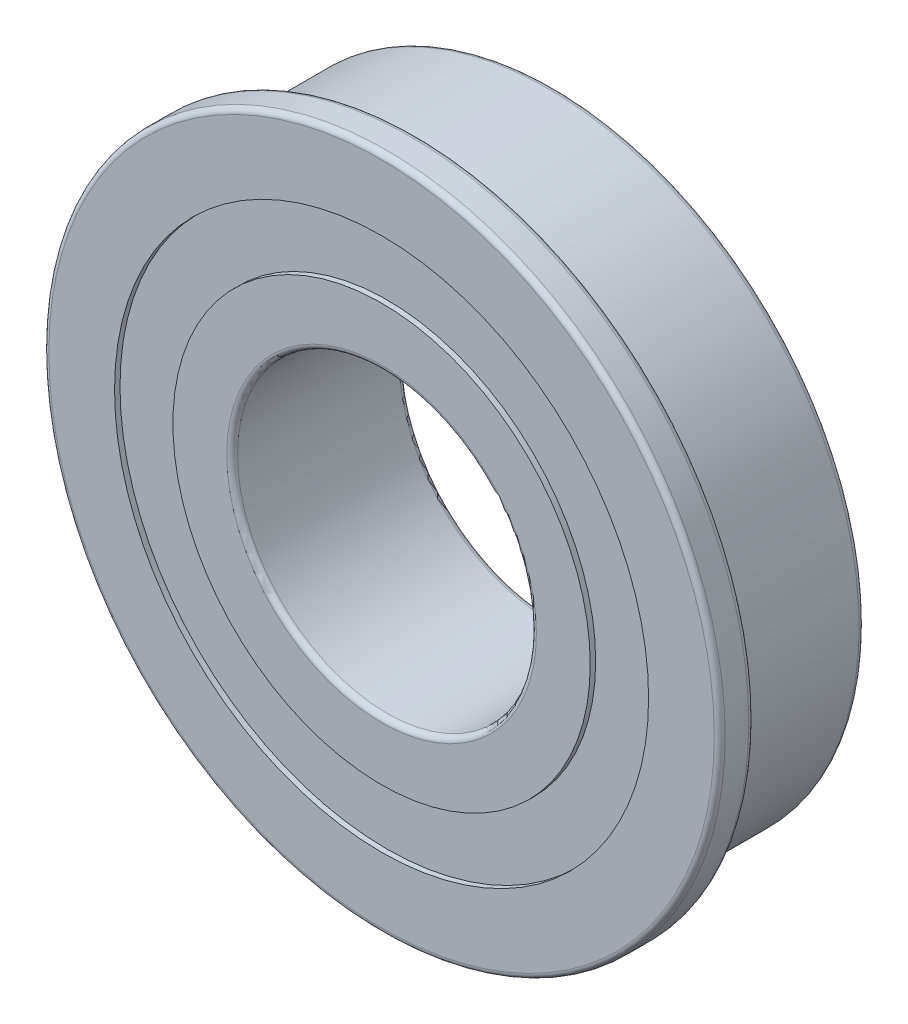
ISO-10303-21;
HEADER;
FILE_DESCRIPTION(('STEP AP214'),'2;1');
FILE_NAME('part.step','',(''),(''),'','','');
FILE_SCHEMA(('AUTOMOTIVE_DESIGN { 1 0 10303 214 1 1 1 1 }'));
ENDSEC;
DATA;
#1=APPLICATION_CONTEXT('core data for automotive mechanical design processes');
#2=APPLICATION_PROTOCOL_DEFINITION('international standard','automotive_design',2000,#1);
#3=PRODUCT_CONTEXT('',#1,'mechanical');
#4=PRODUCT('Part','Part','',(#3));
#5=PRODUCT_RELATED_PRODUCT_CATEGORY('part','',(#4));
#6=PRODUCT_DEFINITION_FORMATION('','',#4);
#7=PRODUCT_DEFINITION_CONTEXT('part definition',#1,'design');
#8=PRODUCT_DEFINITION('design','',#6,#7);
#9=PRODUCT_DEFINITION_SHAPE('','',#8);
#10=(LENGTH_UNIT() NAMED_UNIT(*) SI_UNIT(.MILLI.,.METRE.));
#11=(NAMED_UNIT(*) PLANE_ANGLE_UNIT() SI_UNIT($,.RADIAN.));
#12=(NAMED_UNIT(*) SI_UNIT($,.STERADIAN.) SOLID_ANGLE_UNIT());
#13=UNCERTAINTY_MEASURE_WITH_UNIT(LENGTH_MEASURE(1.E-05),#10,'distance_accuracy_value','');
#14=(GEOMETRIC_REPRESENTATION_CONTEXT(3) GLOBAL_UNCERTAINTY_ASSIGNED_CONTEXT((#13)) GLOBAL_UNIT_ASSIGNED_CONTEXT((#10,
#11,#12)) REPRESENTATION_CONTEXT('',''));
#15=CARTESIAN_POINT('',(0.,0.,0.));
#16=DIRECTION('',(0.,0.,1.));
#17=DIRECTION('',(1.,0.,0.));
#18=AXIS2_PLACEMENT_3D('',#15,#16,#17);
#19=CARTESIAN_POINT('',(0.,0.,53.2489151398073));
#20=DIRECTION('',(0.,0.,1.));
#21=DIRECTION('',(1.,0.,0.));
#22=AXIS2_PLACEMENT_3D('',#19,#20,#21);
#23=CYLINDRICAL_SURFACE('',#22,12.2875);
#24=CARTESIAN_POINT('',(0.,0.,-3.96875));
#25=DIRECTION('',(0.,0.,1.));
#26=DIRECTION('',(1.,0.,0.));
#27=AXIS2_PLACEMENT_3D('',#24,#25,#26);
#28=CIRCLE('',#27,12.2875);
#29=CARTESIAN_POINT('',(12.2875,0.,-3.96875));
#30=VERTEX_POINT('',#29);
#31=EDGE_CURVE('E407',#30,#30,#28,.F.);
#32=ORIENTED_EDGE('',*,*,#31,.T.);
#33=EDGE_LOOP('',(#32));
#34=FACE_BOUND('',#33,.T.);
#35=CARTESIAN_POINT('',(0.,0.,-3.71875));
#36=DIRECTION('',(0.,0.,1.));
#37=DIRECTION('',(1.,0.,0.));
#38=AXIS2_PLACEMENT_3D('',#35,#36,#37);
#39=CIRCLE('',#38,12.2875);
#40=CARTESIAN_POINT('',(12.2875,0.,-3.71875));
#41=VERTEX_POINT('',#40);
#42=EDGE_CURVE('E80',#41,#41,#39,.T.);
#43=ORIENTED_EDGE('',*,*,#42,.T.);
#44=EDGE_LOOP('',(#43));
#45=FACE_BOUND('',#44,.T.);
#46=ADVANCED_FACE('F17',(#34,#45),#23,.F.);
#47=CARTESIAN_POINT('',(0.,12.2875,-3.96875));
#48=DIRECTION('',(0.,0.,1.));
#49=DIRECTION('',(1.,0.,0.));
#50=AXIS2_PLACEMENT_3D('',#47,#48,#49);
#51=PLANE('',#50);
#52=ORIENTED_EDGE('',*,*,#31,.F.);
#53=EDGE_LOOP('',(#52));
#54=FACE_BOUND('',#53,.T.);
#55=CARTESIAN_POINT('',(0.,0.,-3.96875));
#56=DIRECTION('',(0.,0.,1.));
#57=DIRECTION('',(1.,0.,0.));
#58=AXIS2_PLACEMENT_3D('',#55,#56,#57);
#59=CIRCLE('',#58,14.0375);
#60=CARTESIAN_POINT('',(14.0375,0.,-3.96875));
#61=VERTEX_POINT('',#60);
#62=CARTESIAN_POINT('',(-14.0375,0.,-3.96875));
#63=VERTEX_POINT('',#62);
#64=EDGE_CURVE('E70',#61,#63,#59,.T.);
#65=ORIENTED_EDGE('',*,*,#64,.F.);
#66=CARTESIAN_POINT('',(0.,0.,-3.96875));
#67=DIRECTION('',(0.,0.,1.));
#68=DIRECTION('',(-1.,0.,0.));
#69=AXIS2_PLACEMENT_3D('',#66,#67,#68);
#70=CIRCLE('',#69,14.0375);
#71=EDGE_CURVE('E68',#63,#61,#70,.T.);
#72=ORIENTED_EDGE('',*,*,#71,.F.);
#73=EDGE_LOOP('',(#65,#72));
#74=FACE_BOUND('',#73,.T.);
#75=ADVANCED_FACE('F79',(#54,#74),#51,.F.);
#76=CARTESIAN_POINT('',(0.,9.602,-3.71875));
#77=DIRECTION('',(0.,0.,1.));
#78=DIRECTION('',(1.,0.,0.));
#79=AXIS2_PLACEMENT_3D('',#76,#77,#78);
#80=PLANE('',#79);
#81=CARTESIAN_POINT('',(0.,0.,-3.71875));
#82=DIRECTION('',(0.,0.,1.));
#83=DIRECTION('',(1.,0.,0.));
#84=AXIS2_PLACEMENT_3D('',#81,#82,#83);
#85=CIRCLE('',#84,9.602);
#86=CARTESIAN_POINT('',(9.602,0.,-3.71875));
#87=VERTEX_POINT('',#86);
#88=EDGE_CURVE('E75',#87,#87,#85,.F.);
#89=ORIENTED_EDGE('',*,*,#88,.F.);
#90=EDGE_LOOP('',(#89));
#91=FACE_BOUND('',#90,.T.);
#92=ORIENTED_EDGE('',*,*,#42,.F.);
#93=EDGE_LOOP('',(#92));
#94=FACE_BOUND('',#93,.T.);
#95=ADVANCED_FACE('F94',(#91,#94),#80,.F.);
#96=CARTESIAN_POINT('',(0.,0.,-3.71875));
#97=DIRECTION('',(0.,0.,1.));
#98=DIRECTION('',(1.,0.,0.));
#99=AXIS2_PLACEMENT_3D('',#96,#97,#98);
#100=TOROIDAL_SURFACE('',#99,14.0375,0.25);
#101=CARTESIAN_POINT('',(0.,0.,-3.71875));
#102=DIRECTION('',(0.,0.,1.));
#103=DIRECTION('',(1.,0.,0.));
#104=AXIS2_PLACEMENT_3D('',#101,#102,#103);
#105=CIRCLE('',#104,14.2875);
#106=CARTESIAN_POINT('',(14.2875,0.,-3.71875));
#107=VERTEX_POINT('',#106);
#108=EDGE_CURVE('E109',#107,#107,#105,.T.);
#109=ORIENTED_EDGE('',*,*,#108,.F.);
#110=EDGE_LOOP('',(#109));
#111=FACE_BOUND('',#110,.T.);
#112=ORIENTED_EDGE('',*,*,#64,.T.);
#113=ORIENTED_EDGE('',*,*,#71,.T.);
#114=EDGE_LOOP('',(#112,#113));
#115=FACE_BOUND('',#114,.T.);
#116=ADVANCED_FACE('F72',(#111,#115),#100,.T.);
#117=CARTESIAN_POINT('',(0.,0.,53.2489151398073));
#118=DIRECTION('',(0.,0.,1.));
#119=DIRECTION('',(1.,0.,0.));
#120=AXIS2_PLACEMENT_3D('',#117,#118,#119);
#121=CYLINDRICAL_SURFACE('',#120,9.602);
#122=ORIENTED_EDGE('',*,*,#88,.T.);
#123=EDGE_LOOP('',(#122));
#124=FACE_BOUND('',#123,.T.);
#125=CARTESIAN_POINT('',(0.,0.,-3.96875));
#126=DIRECTION('',(0.,0.,1.));
#127=DIRECTION('',(1.,0.,0.));
#128=AXIS2_PLACEMENT_3D('',#125,#126,#127);
#129=CIRCLE('',#128,9.602);
#130=CARTESIAN_POINT('',(9.602,0.,-3.96875));
#131=VERTEX_POINT('',#130);
#132=EDGE_CURVE('E112',#131,#131,#129,.T.);
#133=ORIENTED_EDGE('',*,*,#132,.T.);
#134=EDGE_LOOP('',(#133));
#135=FACE_BOUND('',#134,.T.);
#136=ADVANCED_FACE('F103',(#124,#135),#121,.T.);
#137=CARTESIAN_POINT('',(0.,0.,53.2489151398073));
#138=DIRECTION('',(0.,0.,1.));
#139=DIRECTION('',(1.,0.,0.));
#140=AXIS2_PLACEMENT_3D('',#137,#138,#139);
#141=CYLINDRICAL_SURFACE('',#140,14.2875);
#142=CARTESIAN_POINT('',(0.,0.,1.63125));
#143=DIRECTION('',(0.,0.,-1.));
#144=DIRECTION('',(-1.,0.,0.));
#145=AXIS2_PLACEMENT_3D('',#142,#143,#144);
#146=CIRCLE('',#145,14.2875);
#147=CARTESIAN_POINT('',(-14.2875,0.,1.63125));
#148=VERTEX_POINT('',#147);
#149=EDGE_CURVE('E113',#148,#148,#146,.F.);
#150=ORIENTED_EDGE('',*,*,#149,.F.);
#151=EDGE_LOOP('',(#150));
#152=FACE_BOUND('',#151,.T.);
#153=ORIENTED_EDGE('',*,*,#108,.T.);
#154=EDGE_LOOP('',(#153));
#155=FACE_BOUND('',#154,.T.);
#156=ADVANCED_FACE('F163',(#152,#155),#141,.T.);
#157=CARTESIAN_POINT('',(0.,6.875,-3.96875));
#158=DIRECTION('',(0.,0.,1.));
#159=DIRECTION('',(1.,0.,0.));
#160=AXIS2_PLACEMENT_3D('',#157,#158,#159);
#161=PLANE('',#160);
#162=ORIENTED_EDGE('',*,*,#132,.F.);
#163=EDGE_LOOP('',(#162));
#164=FACE_BOUND('',#163,.T.);
#165=CARTESIAN_POINT('',(0.,0.,-3.96875));
#166=DIRECTION('',(0.,0.,-1.));
#167=DIRECTION('',(1.,0.,0.));
#168=AXIS2_PLACEMENT_3D('',#165,#166,#167);
#169=CIRCLE('',#168,7.125);
#170=CARTESIAN_POINT('',(7.125,0.,-3.96875));
#171=VERTEX_POINT('',#170);
#172=CARTESIAN_POINT('',(-7.125,0.,-3.96875));
#173=VERTEX_POINT('',#172);
#174=EDGE_CURVE('E116',#171,#173,#169,.T.);
#175=ORIENTED_EDGE('',*,*,#174,.F.);
#176=CARTESIAN_POINT('',(0.,0.,-3.96875));
#177=DIRECTION('',(0.,0.,-1.));
#178=DIRECTION('',(-1.,0.,0.));
#179=AXIS2_PLACEMENT_3D('',#176,#177,#178);
#180=CIRCLE('',#179,7.125);
#181=EDGE_CURVE('E147',#173,#171,#180,.T.);
#182=ORIENTED_EDGE('',*,*,#181,.F.);
#183=EDGE_LOOP('',(#175,#182));
#184=FACE_BOUND('',#183,.T.);
#185=ADVANCED_FACE('F155',(#164,#184),#161,.F.);
#186=CARTESIAN_POINT('',(0.,0.,1.63125));
#187=DIRECTION('',(0.,0.,-1.));
#188=DIRECTION('',(-1.,0.,0.));
#189=AXIS2_PLACEMENT_3D('',#186,#187,#188);
#190=CONICAL_SURFACE('',#189,14.2875,0.523598775598298);
#191=ORIENTED_EDGE('',*,*,#149,.T.);
#192=EDGE_LOOP('',(#191));
#193=FACE_BOUND('',#192,.T.);
#194=CARTESIAN_POINT('',(0.,0.,2.00625));
#195=DIRECTION('',(0.,0.,1.));
#196=DIRECTION('',(1.,0.,0.));
#197=AXIS2_PLACEMENT_3D('',#194,#195,#196);
#198=CIRCLE('',#197,14.0709936490539);
#199=CARTESIAN_POINT('',(14.0709936490539,0.,2.00625));
#200=VERTEX_POINT('',#199);
#201=EDGE_CURVE('E144',#200,#200,#198,.F.);
#202=ORIENTED_EDGE('',*,*,#201,.T.);
#203=EDGE_LOOP('',(#202));
#204=FACE_BOUND('',#203,.T.);
#205=ADVANCED_FACE('F134',(#193,#204),#190,.T.);
#206=CARTESIAN_POINT('',(0.,0.,-3.71875));
#207=DIRECTION('',(0.,0.,1.));
#208=DIRECTION('',(1.,0.,0.));
#209=AXIS2_PLACEMENT_3D('',#206,#207,#208);
#210=TOROIDAL_SURFACE('',#209,7.125,0.25);
#211=ORIENTED_EDGE('',*,*,#174,.T.);
#212=ORIENTED_EDGE('',*,*,#181,.T.);
#213=EDGE_LOOP('',(#211,#212));
#214=FACE_BOUND('',#213,.T.);
#215=CARTESIAN_POINT('',(0.,0.,-3.71875));
#216=DIRECTION('',(0.,0.,1.));
#217=DIRECTION('',(1.,0.,0.));
#218=AXIS2_PLACEMENT_3D('',#215,#216,#217);
#219=CIRCLE('',#218,6.875);
#220=CARTESIAN_POINT('',(6.875,0.,-3.71875));
#221=VERTEX_POINT('',#220);
#222=EDGE_CURVE('E142',#221,#221,#219,.T.);
#223=ORIENTED_EDGE('',*,*,#222,.T.);
#224=EDGE_LOOP('',(#223));
#225=FACE_BOUND('',#224,.T.);
#226=ADVANCED_FACE('F122',(#214,#225),#210,.T.);
#227=CARTESIAN_POINT('',(0.,0.,53.2489151398073));
#228=DIRECTION('',(0.,0.,1.));
#229=DIRECTION('',(1.,0.,0.));
#230=AXIS2_PLACEMENT_3D('',#227,#228,#229);
#231=CYLINDRICAL_SURFACE('',#230,6.875);
#232=ORIENTED_EDGE('',*,*,#222,.F.);
#233=EDGE_LOOP('',(#232));
#234=FACE_BOUND('',#233,.T.);
#235=CARTESIAN_POINT('',(0.,0.,3.71875));
#236=DIRECTION('',(0.,0.,-1.));
#237=DIRECTION('',(-1.,0.,0.));
#238=AXIS2_PLACEMENT_3D('',#235,#236,#237);
#239=CIRCLE('',#238,6.875);
#240=CARTESIAN_POINT('',(-6.875,0.,3.71875));
#241=VERTEX_POINT('',#240);
#242=EDGE_CURVE('E386',#241,#241,#239,.T.);
#243=ORIENTED_EDGE('',*,*,#242,.F.);
#244=EDGE_LOOP('',(#243));
#245=FACE_BOUND('',#244,.T.);
#246=ADVANCED_FACE('F133',(#234,#245),#231,.F.);
#247=CARTESIAN_POINT('',(0.,0.,2.13125));
#248=DIRECTION('',(0.,0.,1.));
#249=DIRECTION('',(1.,0.,0.));
#250=AXIS2_PLACEMENT_3D('',#247,#248,#249);
#251=TOROIDAL_SURFACE('',#250,14.2875,0.249999999999998);
#252=ORIENTED_EDGE('',*,*,#201,.F.);
#253=EDGE_LOOP('',(#252));
#254=FACE_BOUND('',#253,.T.);
#255=CARTESIAN_POINT('',(0.,0.,2.38125));
#256=DIRECTION('',(0.,0.,-1.));
#257=DIRECTION('',(1.,0.,0.));
#258=AXIS2_PLACEMENT_3D('',#255,#256,#257);
#259=CIRCLE('',#258,14.2875);
#260=CARTESIAN_POINT('',(14.2875,0.,2.38125));
#261=VERTEX_POINT('',#260);
#262=CARTESIAN_POINT('',(-14.2875,0.,2.38125));
#263=VERTEX_POINT('',#262);
#264=EDGE_CURVE('E388',#261,#263,#259,.T.);
#265=ORIENTED_EDGE('',*,*,#264,.T.);
#266=CARTESIAN_POINT('',(0.,0.,2.38125));
#267=DIRECTION('',(0.,0.,-1.));
#268=DIRECTION('',(-1.,0.,0.));
#269=AXIS2_PLACEMENT_3D('',#266,#267,#268);
#270=CIRCLE('',#269,14.2875);
#271=EDGE_CURVE('E324',#263,#261,#270,.T.);
#272=ORIENTED_EDGE('',*,*,#271,.T.);
#273=EDGE_LOOP('',(#265,#272));
#274=FACE_BOUND('',#273,.T.);
#275=ADVANCED_FACE('F357',(#254,#274),#251,.F.);
#276=CARTESIAN_POINT('',(0.,0.,3.71875));
#277=DIRECTION('',(0.,0.,-1.));
#278=DIRECTION('',(-1.,0.,0.));
#279=AXIS2_PLACEMENT_3D('',#276,#277,#278);
#280=TOROIDAL_SURFACE('',#279,7.125,0.25);
#281=CARTESIAN_POINT('',(0.,0.,3.96875));
#282=DIRECTION('',(0.,0.,1.));
#283=DIRECTION('',(-1.,0.,0.));
#284=AXIS2_PLACEMENT_3D('',#281,#282,#283);
#285=CIRCLE('',#284,7.125);
#286=CARTESIAN_POINT('',(-7.125,0.,3.96875));
#287=VERTEX_POINT('',#286);
#288=CARTESIAN_POINT('',(7.125,0.,3.96875));
#289=VERTEX_POINT('',#288);
#290=EDGE_CURVE('E268',#287,#289,#285,.T.);
#291=ORIENTED_EDGE('',*,*,#290,.T.);
#292=CARTESIAN_POINT('',(0.,0.,3.96875));
#293=DIRECTION('',(0.,0.,1.));
#294=DIRECTION('',(1.,0.,0.));
#295=AXIS2_PLACEMENT_3D('',#292,#293,#294);
#296=CIRCLE('',#295,7.125);
#297=EDGE_CURVE('E279',#289,#287,#296,.T.);
#298=ORIENTED_EDGE('',*,*,#297,.T.);
#299=EDGE_LOOP('',(#291,#298));
#300=FACE_BOUND('',#299,.T.);
#301=ORIENTED_EDGE('',*,*,#242,.T.);
#302=EDGE_LOOP('',(#301));
#303=FACE_BOUND('',#302,.T.);
#304=ADVANCED_FACE('F303',(#300,#303),#280,.T.);
#305=CARTESIAN_POINT('',(0.,14.2875,2.38125));
#306=DIRECTION('',(0.,0.,1.));
#307=DIRECTION('',(1.,0.,0.));
#308=AXIS2_PLACEMENT_3D('',#305,#306,#307);
#309=PLANE('',#308);
#310=ORIENTED_EDGE('',*,*,#264,.F.);
#311=ORIENTED_EDGE('',*,*,#271,.F.);
#312=EDGE_LOOP('',(#310,#311));
#313=FACE_BOUND('',#312,.T.);
#314=CARTESIAN_POINT('',(0.,0.,2.38125));
#315=DIRECTION('',(0.,0.,1.));
#316=DIRECTION('',(1.,0.,0.));
#317=AXIS2_PLACEMENT_3D('',#314,#315,#316);
#318=CIRCLE('',#317,15.31);
#319=CARTESIAN_POINT('',(15.31,0.,2.38125));
#320=VERTEX_POINT('',#319);
#321=CARTESIAN_POINT('',(-15.31,0.,2.38125));
#322=VERTEX_POINT('',#321);
#323=EDGE_CURVE('E237',#320,#322,#318,.T.);
#324=ORIENTED_EDGE('',*,*,#323,.F.);
#325=CARTESIAN_POINT('',(0.,0.,2.38125));
#326=DIRECTION('',(0.,0.,1.));
#327=DIRECTION('',(-1.,0.,0.));
#328=AXIS2_PLACEMENT_3D('',#325,#326,#327);
#329=CIRCLE('',#328,15.31);
#330=EDGE_CURVE('E334',#322,#320,#329,.T.);
#331=ORIENTED_EDGE('',*,*,#330,.F.);
#332=EDGE_LOOP('',(#324,#331));
#333=FACE_BOUND('',#332,.T.);
#334=ADVANCED_FACE('F294',(#313,#333),#309,.F.);
#335=CARTESIAN_POINT('',(0.,9.602,3.96875));
#336=DIRECTION('',(0.,0.,-1.));
#337=DIRECTION('',(-1.,0.,0.));
#338=AXIS2_PLACEMENT_3D('',#335,#336,#337);
#339=PLANE('',#338);
#340=CARTESIAN_POINT('',(0.,0.,3.96875));
#341=DIRECTION('',(0.,0.,1.));
#342=DIRECTION('',(1.,0.,0.));
#343=AXIS2_PLACEMENT_3D('',#340,#341,#342);
#344=CIRCLE('',#343,9.602);
#345=CARTESIAN_POINT('',(9.602,0.,3.96875));
#346=VERTEX_POINT('',#345);
#347=EDGE_CURVE('E392',#346,#346,#344,.F.);
#348=ORIENTED_EDGE('',*,*,#347,.F.);
#349=EDGE_LOOP('',(#348));
#350=FACE_BOUND('',#349,.T.);
#351=ORIENTED_EDGE('',*,*,#290,.F.);
#352=ORIENTED_EDGE('',*,*,#297,.F.);
#353=EDGE_LOOP('',(#351,#352));
#354=FACE_BOUND('',#353,.T.);
#355=ADVANCED_FACE('F257',(#350,#354),#339,.F.);
#356=CARTESIAN_POINT('',(0.,0.,2.63125));
#357=DIRECTION('',(0.,0.,1.));
#358=DIRECTION('',(1.,0.,0.));
#359=AXIS2_PLACEMENT_3D('',#356,#357,#358);
#360=TOROIDAL_SURFACE('',#359,15.31,0.25);
#361=ORIENTED_EDGE('',*,*,#323,.T.);
#362=ORIENTED_EDGE('',*,*,#330,.T.);
#363=EDGE_LOOP('',(#361,#362));
#364=FACE_BOUND('',#363,.T.);
#365=CARTESIAN_POINT('',(0.,0.,2.63125));
#366=DIRECTION('',(0.,0.,1.));
#367=DIRECTION('',(1.,0.,0.));
#368=AXIS2_PLACEMENT_3D('',#365,#366,#367);
#369=CIRCLE('',#368,15.56);
#370=CARTESIAN_POINT('',(15.56,0.,2.63125));
#371=VERTEX_POINT('',#370);
#372=EDGE_CURVE('E265',#371,#371,#369,.T.);
#373=ORIENTED_EDGE('',*,*,#372,.F.);
#374=EDGE_LOOP('',(#373));
#375=FACE_BOUND('',#374,.T.);
#376=ADVANCED_FACE('F245',(#364,#375),#360,.T.);
#377=CARTESIAN_POINT('',(0.,0.,53.2489151398073));
#378=DIRECTION('',(0.,0.,1.));
#379=DIRECTION('',(1.,0.,0.));
#380=AXIS2_PLACEMENT_3D('',#377,#378,#379);
#381=CYLINDRICAL_SURFACE('',#380,9.602);
#382=ORIENTED_EDGE('',*,*,#347,.T.);
#383=EDGE_LOOP('',(#382));
#384=FACE_BOUND('',#383,.T.);
#385=CARTESIAN_POINT('',(0.,0.,3.71875));
#386=DIRECTION('',(0.,0.,1.));
#387=DIRECTION('',(1.,0.,0.));
#388=AXIS2_PLACEMENT_3D('',#385,#386,#387);
#389=CIRCLE('',#388,9.602);
#390=CARTESIAN_POINT('',(9.602,0.,3.71875));
#391=VERTEX_POINT('',#390);
#392=EDGE_CURVE('E398',#391,#391,#389,.T.);
#393=ORIENTED_EDGE('',*,*,#392,.T.);
#394=EDGE_LOOP('',(#393));
#395=FACE_BOUND('',#394,.T.);
#396=ADVANCED_FACE('F256',(#384,#395),#381,.T.);
#397=CARTESIAN_POINT('',(0.,0.,53.2489151398073));
#398=DIRECTION('',(0.,0.,1.));
#399=DIRECTION('',(1.,0.,0.));
#400=AXIS2_PLACEMENT_3D('',#397,#398,#399);
#401=CYLINDRICAL_SURFACE('',#400,15.56);
#402=ORIENTED_EDGE('',*,*,#372,.T.);
#403=EDGE_LOOP('',(#402));
#404=FACE_BOUND('',#403,.T.);
#405=CARTESIAN_POINT('',(0.,0.,3.71875));
#406=DIRECTION('',(0.,0.,-1.));
#407=DIRECTION('',(-1.,0.,0.));
#408=AXIS2_PLACEMENT_3D('',#405,#406,#407);
#409=CIRCLE('',#408,15.56);
#410=CARTESIAN_POINT('',(-15.56,0.,3.71875));
#411=VERTEX_POINT('',#410);
#412=EDGE_CURVE('E554',#411,#411,#409,.F.);
#413=ORIENTED_EDGE('',*,*,#412,.F.);
#414=EDGE_LOOP('',(#413));
#415=FACE_BOUND('',#414,.T.);
#416=ADVANCED_FACE('F510',(#404,#415),#401,.T.);
#417=CARTESIAN_POINT('',(0.,12.2875,3.71875));
#418=DIRECTION('',(0.,0.,-1.));
#419=DIRECTION('',(-1.,0.,0.));
#420=AXIS2_PLACEMENT_3D('',#417,#418,#419);
#421=PLANE('',#420);
#422=CARTESIAN_POINT('',(0.,0.,3.71875));
#423=DIRECTION('',(0.,0.,1.));
#424=DIRECTION('',(1.,0.,0.));
#425=AXIS2_PLACEMENT_3D('',#422,#423,#424);
#426=CIRCLE('',#425,12.2875);
#427=CARTESIAN_POINT('',(12.2875,0.,3.71875));
#428=VERTEX_POINT('',#427);
#429=EDGE_CURVE('E550',#428,#428,#426,.T.);
#430=ORIENTED_EDGE('',*,*,#429,.T.);
#431=EDGE_LOOP('',(#430));
#432=FACE_BOUND('',#431,.T.);
#433=ORIENTED_EDGE('',*,*,#392,.F.);
#434=EDGE_LOOP('',(#433));
#435=FACE_BOUND('',#434,.T.);
#436=ADVANCED_FACE('F216',(#432,#435),#421,.F.);
#437=CARTESIAN_POINT('',(0.,0.,3.71875));
#438=DIRECTION('',(0.,0.,-1.));
#439=DIRECTION('',(-1.,0.,0.));
#440=AXIS2_PLACEMENT_3D('',#437,#438,#439);
#441=TOROIDAL_SURFACE('',#440,15.31,0.25);
#442=CARTESIAN_POINT('',(0.,0.,3.96875));
#443=DIRECTION('',(0.,0.,-1.));
#444=DIRECTION('',(-1.,0.,0.));
#445=AXIS2_PLACEMENT_3D('',#442,#443,#444);
#446=CIRCLE('',#445,15.31);
#447=CARTESIAN_POINT('',(-15.31,0.,3.96875));
#448=VERTEX_POINT('',#447);
#449=CARTESIAN_POINT('',(15.31,0.,3.96875));
#450=VERTEX_POINT('',#449);
#451=EDGE_CURVE('E558',#448,#450,#446,.T.);
#452=ORIENTED_EDGE('',*,*,#451,.T.);
#453=CARTESIAN_POINT('',(0.,0.,3.96875));
#454=DIRECTION('',(0.,0.,-1.));
#455=DIRECTION('',(1.,0.,0.));
#456=AXIS2_PLACEMENT_3D('',#453,#454,#455);
#457=CIRCLE('',#456,15.31);
#458=EDGE_CURVE('E28',#450,#448,#457,.T.);
#459=ORIENTED_EDGE('',*,*,#458,.T.);
#460=EDGE_LOOP('',(#452,#459));
#461=FACE_BOUND('',#460,.T.);
#462=ORIENTED_EDGE('',*,*,#412,.T.);
#463=EDGE_LOOP('',(#462));
#464=FACE_BOUND('',#463,.T.);
#465=ADVANCED_FACE('F190',(#461,#464),#441,.T.);
#466=CARTESIAN_POINT('',(0.,0.,53.2489151398073));
#467=DIRECTION('',(0.,0.,1.));
#468=DIRECTION('',(1.,0.,0.));
#469=AXIS2_PLACEMENT_3D('',#466,#467,#468);
#470=CYLINDRICAL_SURFACE('',#469,12.2875);
#471=ORIENTED_EDGE('',*,*,#429,.F.);
#472=EDGE_LOOP('',(#471));
#473=FACE_BOUND('',#472,.T.);
#474=CARTESIAN_POINT('',(0.,0.,3.96875));
#475=DIRECTION('',(0.,0.,1.));
#476=DIRECTION('',(1.,0.,0.));
#477=AXIS2_PLACEMENT_3D('',#474,#475,#476);
#478=CIRCLE('',#477,12.2875);
#479=CARTESIAN_POINT('',(12.2875,0.,3.96875));
#480=VERTEX_POINT('',#479);
#481=EDGE_CURVE('E10',#480,#480,#478,.T.);
#482=ORIENTED_EDGE('',*,*,#481,.T.);
#483=EDGE_LOOP('',(#482));
#484=FACE_BOUND('',#483,.T.);
#485=ADVANCED_FACE('F184',(#473,#484),#470,.F.);
#486=CARTESIAN_POINT('',(0.,15.56,3.96875));
#487=DIRECTION('',(0.,0.,-1.));
#488=DIRECTION('',(-1.,0.,0.));
#489=AXIS2_PLACEMENT_3D('',#486,#487,#488);
#490=PLANE('',#489);
#491=ORIENTED_EDGE('',*,*,#481,.F.);
#492=EDGE_LOOP('',(#491));
#493=FACE_BOUND('',#492,.T.);
#494=ORIENTED_EDGE('',*,*,#451,.F.);
#495=ORIENTED_EDGE('',*,*,#458,.F.);
#496=EDGE_LOOP('',(#494,#495));
#497=FACE_BOUND('',#496,.T.);
#498=ADVANCED_FACE('F182',(#493,#497),#490,.F.);
#499=CLOSED_SHELL('',(#46,#75,#95,#116,#136,#156,#185,#205,#226,#246,#275,#304,#334,#355,#376,
#396,#416,#436,#465,#485,#498));
#500=MANIFOLD_SOLID_BREP('B1',#499);
#501=ADVANCED_BREP_SHAPE_REPRESENTATION('',(#18,#500),#14);
#502=SHAPE_DEFINITION_REPRESENTATION(#9,#501);
ENDSEC;
END-ISO-10303-21;
